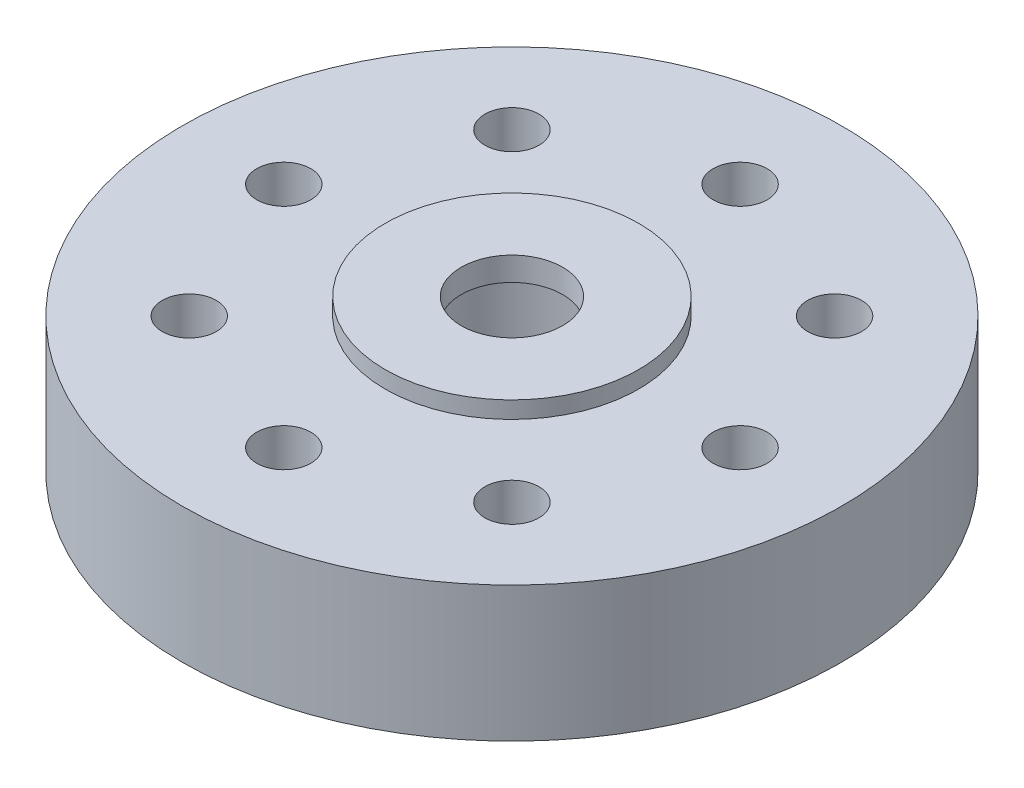
ISO-10303-21;
HEADER;
FILE_DESCRIPTION(('STEP AP214'),'2;1');
FILE_NAME('part.step','',(''),(''),'','','');
FILE_SCHEMA(('AUTOMOTIVE_DESIGN { 1 0 10303 214 1 1 1 1 }'));
ENDSEC;
DATA;
#1=APPLICATION_CONTEXT('core data for automotive mechanical design processes');
#2=APPLICATION_PROTOCOL_DEFINITION('international standard','automotive_design',2000,#1);
#3=PRODUCT_CONTEXT('',#1,'mechanical');
#4=PRODUCT('Part','Part','',(#3));
#5=PRODUCT_RELATED_PRODUCT_CATEGORY('part','',(#4));
#6=PRODUCT_DEFINITION_FORMATION('','',#4);
#7=PRODUCT_DEFINITION_CONTEXT('part definition',#1,'design');
#8=PRODUCT_DEFINITION('design','',#6,#7);
#9=PRODUCT_DEFINITION_SHAPE('','',#8);
#10=(LENGTH_UNIT() NAMED_UNIT(*) SI_UNIT(.MILLI.,.METRE.));
#11=(NAMED_UNIT(*) PLANE_ANGLE_UNIT() SI_UNIT($,.RADIAN.));
#12=(NAMED_UNIT(*) SI_UNIT($,.STERADIAN.) SOLID_ANGLE_UNIT());
#13=UNCERTAINTY_MEASURE_WITH_UNIT(LENGTH_MEASURE(1.E-05),#10,'distance_accuracy_value','');
#14=(GEOMETRIC_REPRESENTATION_CONTEXT(3) GLOBAL_UNCERTAINTY_ASSIGNED_CONTEXT((#13)) GLOBAL_UNIT_ASSIGNED_CONTEXT((#10,
#11,#12)) REPRESENTATION_CONTEXT('',''));
#15=CARTESIAN_POINT('',(0.,0.,0.));
#16=DIRECTION('',(0.,0.,1.));
#17=DIRECTION('',(1.,0.,0.));
#18=AXIS2_PLACEMENT_3D('',#15,#16,#17);
#19=CARTESIAN_POINT('',(0.,2.,0.));
#20=DIRECTION('',(0.,-1.,0.));
#21=DIRECTION('',(0.,0.,-1.));
#22=AXIS2_PLACEMENT_3D('',#19,#20,#21);
#23=CYLINDRICAL_SURFACE('',#22,1.5);
#24=CARTESIAN_POINT('',(0.,2.5,0.));
#25=DIRECTION('',(0.,1.,0.));
#26=DIRECTION('',(0.,0.,1.));
#27=AXIS2_PLACEMENT_3D('',#24,#25,#26);
#28=CIRCLE('',#27,1.5);
#29=CARTESIAN_POINT('',(0.,2.5,1.5));
#30=VERTEX_POINT('',#29);
#31=EDGE_CURVE('E250',#30,#30,#28,.T.);
#32=ORIENTED_EDGE('',*,*,#31,.T.);
#33=EDGE_LOOP('',(#32));
#34=FACE_BOUND('',#33,.T.);
#35=CARTESIAN_POINT('',(0.,1.8,0.));
#36=DIRECTION('',(0.,-1.,0.));
#37=DIRECTION('',(0.,0.,-1.));
#38=AXIS2_PLACEMENT_3D('',#35,#36,#37);
#39=CIRCLE('',#38,1.5);
#40=CARTESIAN_POINT('',(0.,1.8,-1.5));
#41=VERTEX_POINT('',#40);
#42=EDGE_CURVE('E331',#41,#41,#39,.T.);
#43=ORIENTED_EDGE('',*,*,#42,.T.);
#44=EDGE_LOOP('',(#43));
#45=FACE_BOUND('',#44,.T.);
#46=ADVANCED_FACE('F36',(#34,#45),#23,.F.);
#47=CARTESIAN_POINT('',(0.,-2.,0.));
#48=DIRECTION('',(0.,1.,0.));
#49=DIRECTION('',(0.,0.,1.));
#50=AXIS2_PLACEMENT_3D('',#47,#48,#49);
#51=PLANE('',#50);
#52=CARTESIAN_POINT('',(0.,-2.,0.));
#53=DIRECTION('',(0.,1.,0.));
#54=DIRECTION('',(0.,0.,1.));
#55=AXIS2_PLACEMENT_3D('',#52,#53,#54);
#56=CIRCLE('',#55,9.75);
#57=CARTESIAN_POINT('',(0.,-2.,9.75));
#58=VERTEX_POINT('',#57);
#59=EDGE_CURVE('E287',#58,#58,#56,.T.);
#60=ORIENTED_EDGE('',*,*,#59,.F.);
#61=EDGE_LOOP('',(#60));
#62=FACE_BOUND('',#61,.T.);
#63=CARTESIAN_POINT('',(6.75,-2.,0.));
#64=DIRECTION('',(0.,1.,0.));
#65=DIRECTION('',(0.,0.,1.));
#66=AXIS2_PLACEMENT_3D('',#63,#64,#65);
#67=CIRCLE('',#66,0.800000000000001);
#68=CARTESIAN_POINT('',(6.75,-2.,0.800000000000001));
#69=VERTEX_POINT('',#68);
#70=EDGE_CURVE('E327',#69,#69,#67,.T.);
#71=ORIENTED_EDGE('',*,*,#70,.T.);
#72=EDGE_LOOP('',(#71));
#73=FACE_BOUND('',#72,.T.);
#74=CARTESIAN_POINT('',(0.,-2.,6.75));
#75=DIRECTION('',(0.,1.,0.));
#76=DIRECTION('',(0.,0.,1.));
#77=AXIS2_PLACEMENT_3D('',#74,#75,#76);
#78=CIRCLE('',#77,0.8);
#79=CARTESIAN_POINT('',(0.,-2.,7.55));
#80=VERTEX_POINT('',#79);
#81=EDGE_CURVE('E324',#80,#80,#78,.T.);
#82=ORIENTED_EDGE('',*,*,#81,.T.);
#83=EDGE_LOOP('',(#82));
#84=FACE_BOUND('',#83,.T.);
#85=CARTESIAN_POINT('',(-6.75,-2.,0.));
#86=DIRECTION('',(0.,1.,0.));
#87=DIRECTION('',(0.,0.,1.));
#88=AXIS2_PLACEMENT_3D('',#85,#86,#87);
#89=CIRCLE('',#88,0.800000000000001);
#90=CARTESIAN_POINT('',(-6.75,-2.,0.800000000000001));
#91=VERTEX_POINT('',#90);
#92=EDGE_CURVE('E321',#91,#91,#89,.T.);
#93=ORIENTED_EDGE('',*,*,#92,.T.);
#94=EDGE_LOOP('',(#93));
#95=FACE_BOUND('',#94,.T.);
#96=CARTESIAN_POINT('',(0.,-2.,-6.75));
#97=DIRECTION('',(0.,1.,0.));
#98=DIRECTION('',(0.,0.,1.));
#99=AXIS2_PLACEMENT_3D('',#96,#97,#98);
#100=CIRCLE('',#99,0.8);
#101=CARTESIAN_POINT('',(0.,-2.,-5.95));
#102=VERTEX_POINT('',#101);
#103=EDGE_CURVE('E318',#102,#102,#100,.T.);
#104=ORIENTED_EDGE('',*,*,#103,.T.);
#105=EDGE_LOOP('',(#104));
#106=FACE_BOUND('',#105,.T.);
#107=CARTESIAN_POINT('',(4.7729707730092,-2.,4.7729707730092));
#108=DIRECTION('',(0.,1.,0.));
#109=DIRECTION('',(0.,0.,1.));
#110=AXIS2_PLACEMENT_3D('',#107,#108,#109);
#111=CIRCLE('',#110,0.800000000000001);
#112=CARTESIAN_POINT('',(4.7729707730092,-2.,5.5729707730092));
#113=VERTEX_POINT('',#112);
#114=EDGE_CURVE('E315',#113,#113,#111,.T.);
#115=ORIENTED_EDGE('',*,*,#114,.T.);
#116=EDGE_LOOP('',(#115));
#117=FACE_BOUND('',#116,.T.);
#118=CARTESIAN_POINT('',(-4.7729707730092,-2.,4.7729707730092));
#119=DIRECTION('',(0.,1.,0.));
#120=DIRECTION('',(0.,0.,1.));
#121=AXIS2_PLACEMENT_3D('',#118,#119,#120);
#122=CIRCLE('',#121,0.8);
#123=CARTESIAN_POINT('',(-4.7729707730092,-2.,5.5729707730092));
#124=VERTEX_POINT('',#123);
#125=EDGE_CURVE('E312',#124,#124,#122,.T.);
#126=ORIENTED_EDGE('',*,*,#125,.T.);
#127=EDGE_LOOP('',(#126));
#128=FACE_BOUND('',#127,.T.);
#129=CARTESIAN_POINT('',(-4.7729707730092,-2.,-4.7729707730092));
#130=DIRECTION('',(0.,1.,0.));
#131=DIRECTION('',(0.,0.,1.));
#132=AXIS2_PLACEMENT_3D('',#129,#130,#131);
#133=CIRCLE('',#132,0.8);
#134=CARTESIAN_POINT('',(-4.7729707730092,-2.,-3.97297077300919));
#135=VERTEX_POINT('',#134);
#136=EDGE_CURVE('E309',#135,#135,#133,.T.);
#137=ORIENTED_EDGE('',*,*,#136,.T.);
#138=EDGE_LOOP('',(#137));
#139=FACE_BOUND('',#138,.T.);
#140=CARTESIAN_POINT('',(4.77297077300919,-2.,-4.7729707730092));
#141=DIRECTION('',(0.,1.,0.));
#142=DIRECTION('',(0.,0.,1.));
#143=AXIS2_PLACEMENT_3D('',#140,#141,#142);
#144=CIRCLE('',#143,0.800000000000001);
#145=CARTESIAN_POINT('',(4.77297077300919,-2.,-3.9729707730092));
#146=VERTEX_POINT('',#145);
#147=EDGE_CURVE('E282',#146,#146,#144,.T.);
#148=ORIENTED_EDGE('',*,*,#147,.T.);
#149=EDGE_LOOP('',(#148));
#150=FACE_BOUND('',#149,.T.);
#151=CARTESIAN_POINT('',(4.77297077300919,-2.,4.7729707730092));
#152=DIRECTION('',(0.,-1.,0.));
#153=DIRECTION('',(0.,0.,-1.));
#154=AXIS2_PLACEMENT_3D('',#151,#152,#153);
#155=CIRCLE('',#154,2.);
#156=CARTESIAN_POINT('',(5.31331654942509,-2.,6.69859442313128));
#157=VERTEX_POINT('',#156);
#158=CARTESIAN_POINT('',(6.69859442313128,-2.,5.31331654942509));
#159=VERTEX_POINT('',#158);
#160=EDGE_CURVE('E53',#157,#159,#155,.T.);
#161=ORIENTED_EDGE('',*,*,#160,.T.);
#162=CARTESIAN_POINT('',(0.,-2.,0.));
#163=DIRECTION('',(0.,-1.,0.));
#164=DIRECTION('',(0.,0.,-1.));
#165=AXIS2_PLACEMENT_3D('',#162,#163,#164);
#166=CIRCLE('',#165,8.55);
#167=CARTESIAN_POINT('',(8.49370370370371,-2.,0.979539378325329));
#168=VERTEX_POINT('',#167);
#169=EDGE_CURVE('E224',#168,#159,#166,.T.);
#170=ORIENTED_EDGE('',*,*,#169,.F.);
#171=CARTESIAN_POINT('',(6.75,-2.,0.));
#172=DIRECTION('',(0.,-1.,0.));
#173=DIRECTION('',(0.,0.,-1.));
#174=AXIS2_PLACEMENT_3D('',#171,#172,#173);
#175=CIRCLE('',#174,2.);
#176=CARTESIAN_POINT('',(8.49370370370371,-2.,-0.979539378325329));
#177=VERTEX_POINT('',#176);
#178=EDGE_CURVE('E247',#168,#177,#175,.T.);
#179=ORIENTED_EDGE('',*,*,#178,.T.);
#180=CARTESIAN_POINT('',(6.69859442313128,-2.,-5.31331654942509));
#181=VERTEX_POINT('',#180);
#182=EDGE_CURVE('E170',#181,#177,#166,.T.);
#183=ORIENTED_EDGE('',*,*,#182,.F.);
#184=CARTESIAN_POINT('',(4.7729707730092,-2.,-4.7729707730092));
#185=DIRECTION('',(0.,-1.,0.));
#186=DIRECTION('',(0.,0.,-1.));
#187=AXIS2_PLACEMENT_3D('',#184,#185,#186);
#188=CIRCLE('',#187,2.);
#189=CARTESIAN_POINT('',(5.31331654942509,-2.,-6.69859442313128));
#190=VERTEX_POINT('',#189);
#191=EDGE_CURVE('E244',#181,#190,#188,.T.);
#192=ORIENTED_EDGE('',*,*,#191,.T.);
#193=CARTESIAN_POINT('',(0.97953937832533,-2.,-8.49370370370371));
#194=VERTEX_POINT('',#193);
#195=EDGE_CURVE('E243',#194,#190,#166,.T.);
#196=ORIENTED_EDGE('',*,*,#195,.F.);
#197=CARTESIAN_POINT('',(0.,-2.,-6.75));
#198=DIRECTION('',(0.,-1.,0.));
#199=DIRECTION('',(0.,0.,-1.));
#200=AXIS2_PLACEMENT_3D('',#197,#198,#199);
#201=CIRCLE('',#200,2.);
#202=CARTESIAN_POINT('',(-0.979539378325328,-2.,-8.49370370370371));
#203=VERTEX_POINT('',#202);
#204=EDGE_CURVE('E240',#194,#203,#201,.T.);
#205=ORIENTED_EDGE('',*,*,#204,.T.);
#206=CARTESIAN_POINT('',(-5.31331654942509,-2.,-6.69859442313128));
#207=VERTEX_POINT('',#206);
#208=EDGE_CURVE('E239',#207,#203,#166,.T.);
#209=ORIENTED_EDGE('',*,*,#208,.F.);
#210=CARTESIAN_POINT('',(-4.7729707730092,-2.,-4.7729707730092));
#211=DIRECTION('',(0.,-1.,0.));
#212=DIRECTION('',(0.,0.,-1.));
#213=AXIS2_PLACEMENT_3D('',#210,#211,#212);
#214=CIRCLE('',#213,2.);
#215=CARTESIAN_POINT('',(-6.69859442313128,-2.,-5.31331654942509));
#216=VERTEX_POINT('',#215);
#217=EDGE_CURVE('E236',#207,#216,#214,.T.);
#218=ORIENTED_EDGE('',*,*,#217,.T.);
#219=CARTESIAN_POINT('',(-8.49370370370371,-2.,-0.97953937832533));
#220=VERTEX_POINT('',#219);
#221=EDGE_CURVE('E235',#220,#216,#166,.T.);
#222=ORIENTED_EDGE('',*,*,#221,.F.);
#223=CARTESIAN_POINT('',(-6.75,-2.,0.));
#224=DIRECTION('',(0.,-1.,0.));
#225=DIRECTION('',(0.,0.,-1.));
#226=AXIS2_PLACEMENT_3D('',#223,#224,#225);
#227=CIRCLE('',#226,2.);
#228=CARTESIAN_POINT('',(-8.49370370370371,-2.,0.979539378325327));
#229=VERTEX_POINT('',#228);
#230=EDGE_CURVE('E232',#220,#229,#227,.T.);
#231=ORIENTED_EDGE('',*,*,#230,.T.);
#232=CARTESIAN_POINT('',(-6.69859442313128,-2.,5.31331654942509));
#233=VERTEX_POINT('',#232);
#234=EDGE_CURVE('E231',#233,#229,#166,.T.);
#235=ORIENTED_EDGE('',*,*,#234,.F.);
#236=CARTESIAN_POINT('',(-4.7729707730092,-2.,4.7729707730092));
#237=DIRECTION('',(0.,-1.,0.));
#238=DIRECTION('',(0.,0.,-1.));
#239=AXIS2_PLACEMENT_3D('',#236,#237,#238);
#240=CIRCLE('',#239,2.);
#241=CARTESIAN_POINT('',(-5.31331654942509,-2.,6.69859442313128));
#242=VERTEX_POINT('',#241);
#243=EDGE_CURVE('E228',#233,#242,#240,.T.);
#244=ORIENTED_EDGE('',*,*,#243,.T.);
#245=CARTESIAN_POINT('',(-0.979539378325331,-2.,8.49370370370371));
#246=VERTEX_POINT('',#245);
#247=EDGE_CURVE('E225',#246,#242,#166,.T.);
#248=ORIENTED_EDGE('',*,*,#247,.F.);
#249=CARTESIAN_POINT('',(0.,-2.,6.75));
#250=DIRECTION('',(0.,-1.,0.));
#251=DIRECTION('',(0.,0.,-1.));
#252=AXIS2_PLACEMENT_3D('',#249,#250,#251);
#253=CIRCLE('',#252,2.);
#254=CARTESIAN_POINT('',(0.979539378325327,-2.,8.49370370370371));
#255=VERTEX_POINT('',#254);
#256=EDGE_CURVE('E223',#246,#255,#253,.T.);
#257=ORIENTED_EDGE('',*,*,#256,.T.);
#258=EDGE_CURVE('E219',#157,#255,#166,.T.);
#259=ORIENTED_EDGE('',*,*,#258,.F.);
#260=EDGE_LOOP('',(#161,#170,#179,#183,#192,#196,#205,#209,#218,#222,#231,#235,#244,#248,#257,#259));
#261=FACE_BOUND('',#260,.T.);
#262=ADVANCED_FACE('F372',(#62,#73,#84,#95,#106,#117,#128,#139,#150,#261),#51,.F.);
#263=CARTESIAN_POINT('',(0.,2.,0.));
#264=DIRECTION('',(0.,-1.,0.));
#265=DIRECTION('',(0.,0.,-1.));
#266=AXIS2_PLACEMENT_3D('',#263,#264,#265);
#267=CYLINDRICAL_SURFACE('',#266,9.75);
#268=CARTESIAN_POINT('',(0.,2.,0.));
#269=DIRECTION('',(0.,1.,0.));
#270=DIRECTION('',(0.,0.,1.));
#271=AXIS2_PLACEMENT_3D('',#268,#269,#270);
#272=CIRCLE('',#271,9.75);
#273=CARTESIAN_POINT('',(0.,2.,9.75));
#274=VERTEX_POINT('',#273);
#275=EDGE_CURVE('E11',#274,#274,#272,.T.);
#276=ORIENTED_EDGE('',*,*,#275,.F.);
#277=EDGE_LOOP('',(#276));
#278=FACE_BOUND('',#277,.T.);
#279=ORIENTED_EDGE('',*,*,#59,.T.);
#280=EDGE_LOOP('',(#279));
#281=FACE_BOUND('',#280,.T.);
#282=ADVANCED_FACE('F410',(#278,#281),#267,.T.);
#283=CARTESIAN_POINT('',(6.75,2.,0.));
#284=DIRECTION('',(0.,-1.,0.));
#285=DIRECTION('',(0.,0.,-1.));
#286=AXIS2_PLACEMENT_3D('',#283,#284,#285);
#287=CYLINDRICAL_SURFACE('',#286,0.800000000000001);
#288=CARTESIAN_POINT('',(6.75,2.,0.));
#289=DIRECTION('',(0.,1.,0.));
#290=DIRECTION('',(0.,0.,1.));
#291=AXIS2_PLACEMENT_3D('',#288,#289,#290);
#292=CIRCLE('',#291,0.800000000000001);
#293=CARTESIAN_POINT('',(6.75,2.,0.800000000000001));
#294=VERTEX_POINT('',#293);
#295=EDGE_CURVE('E45',#294,#294,#292,.T.);
#296=ORIENTED_EDGE('',*,*,#295,.T.);
#297=EDGE_LOOP('',(#296));
#298=FACE_BOUND('',#297,.T.);
#299=ORIENTED_EDGE('',*,*,#70,.F.);
#300=EDGE_LOOP('',(#299));
#301=FACE_BOUND('',#300,.T.);
#302=ADVANCED_FACE('F417',(#298,#301),#287,.F.);
#303=CARTESIAN_POINT('',(0.,2.,6.75));
#304=DIRECTION('',(0.,-1.,0.));
#305=DIRECTION('',(0.,0.,-1.));
#306=AXIS2_PLACEMENT_3D('',#303,#304,#305);
#307=CYLINDRICAL_SURFACE('',#306,0.8);
#308=CARTESIAN_POINT('',(0.,2.,6.75));
#309=DIRECTION('',(0.,1.,0.));
#310=DIRECTION('',(0.,0.,1.));
#311=AXIS2_PLACEMENT_3D('',#308,#309,#310);
#312=CIRCLE('',#311,0.8);
#313=CARTESIAN_POINT('',(0.,2.,7.55));
#314=VERTEX_POINT('',#313);
#315=EDGE_CURVE('E302',#314,#314,#312,.T.);
#316=ORIENTED_EDGE('',*,*,#315,.T.);
#317=EDGE_LOOP('',(#316));
#318=FACE_BOUND('',#317,.T.);
#319=ORIENTED_EDGE('',*,*,#81,.F.);
#320=EDGE_LOOP('',(#319));
#321=FACE_BOUND('',#320,.T.);
#322=ADVANCED_FACE('F421',(#318,#321),#307,.F.);
#323=CARTESIAN_POINT('',(-6.75,2.,0.));
#324=DIRECTION('',(0.,-1.,0.));
#325=DIRECTION('',(0.,0.,-1.));
#326=AXIS2_PLACEMENT_3D('',#323,#324,#325);
#327=CYLINDRICAL_SURFACE('',#326,0.800000000000001);
#328=CARTESIAN_POINT('',(-6.75,2.,0.));
#329=DIRECTION('',(0.,1.,0.));
#330=DIRECTION('',(0.,0.,1.));
#331=AXIS2_PLACEMENT_3D('',#328,#329,#330);
#332=CIRCLE('',#331,0.800000000000001);
#333=CARTESIAN_POINT('',(-6.75,2.,0.800000000000001));
#334=VERTEX_POINT('',#333);
#335=EDGE_CURVE('E299',#334,#334,#332,.T.);
#336=ORIENTED_EDGE('',*,*,#335,.T.);
#337=EDGE_LOOP('',(#336));
#338=FACE_BOUND('',#337,.T.);
#339=ORIENTED_EDGE('',*,*,#92,.F.);
#340=EDGE_LOOP('',(#339));
#341=FACE_BOUND('',#340,.T.);
#342=ADVANCED_FACE('F425',(#338,#341),#327,.F.);
#343=CARTESIAN_POINT('',(0.,2.,-6.75));
#344=DIRECTION('',(0.,-1.,0.));
#345=DIRECTION('',(0.,0.,-1.));
#346=AXIS2_PLACEMENT_3D('',#343,#344,#345);
#347=CYLINDRICAL_SURFACE('',#346,0.8);
#348=CARTESIAN_POINT('',(0.,2.,-6.75));
#349=DIRECTION('',(0.,1.,0.));
#350=DIRECTION('',(0.,0.,1.));
#351=AXIS2_PLACEMENT_3D('',#348,#349,#350);
#352=CIRCLE('',#351,0.8);
#353=CARTESIAN_POINT('',(0.,2.,-5.95));
#354=VERTEX_POINT('',#353);
#355=EDGE_CURVE('E296',#354,#354,#352,.T.);
#356=ORIENTED_EDGE('',*,*,#355,.T.);
#357=EDGE_LOOP('',(#356));
#358=FACE_BOUND('',#357,.T.);
#359=ORIENTED_EDGE('',*,*,#103,.F.);
#360=EDGE_LOOP('',(#359));
#361=FACE_BOUND('',#360,.T.);
#362=ADVANCED_FACE('F429',(#358,#361),#347,.F.);
#363=CARTESIAN_POINT('',(4.7729707730092,2.,4.7729707730092));
#364=DIRECTION('',(0.,-1.,0.));
#365=DIRECTION('',(0.,0.,-1.));
#366=AXIS2_PLACEMENT_3D('',#363,#364,#365);
#367=CYLINDRICAL_SURFACE('',#366,0.800000000000001);
#368=CARTESIAN_POINT('',(4.7729707730092,2.,4.7729707730092));
#369=DIRECTION('',(0.,1.,0.));
#370=DIRECTION('',(0.,0.,1.));
#371=AXIS2_PLACEMENT_3D('',#368,#369,#370);
#372=CIRCLE('',#371,0.800000000000001);
#373=CARTESIAN_POINT('',(4.7729707730092,2.,5.5729707730092));
#374=VERTEX_POINT('',#373);
#375=EDGE_CURVE('E293',#374,#374,#372,.T.);
#376=ORIENTED_EDGE('',*,*,#375,.T.);
#377=EDGE_LOOP('',(#376));
#378=FACE_BOUND('',#377,.T.);
#379=ORIENTED_EDGE('',*,*,#114,.F.);
#380=EDGE_LOOP('',(#379));
#381=FACE_BOUND('',#380,.T.);
#382=ADVANCED_FACE('F433',(#378,#381),#367,.F.);
#383=CARTESIAN_POINT('',(-4.7729707730092,2.,4.7729707730092));
#384=DIRECTION('',(0.,-1.,0.));
#385=DIRECTION('',(0.,0.,-1.));
#386=AXIS2_PLACEMENT_3D('',#383,#384,#385);
#387=CYLINDRICAL_SURFACE('',#386,0.8);
#388=CARTESIAN_POINT('',(-4.7729707730092,2.,4.7729707730092));
#389=DIRECTION('',(0.,1.,0.));
#390=DIRECTION('',(0.,0.,1.));
#391=AXIS2_PLACEMENT_3D('',#388,#389,#390);
#392=CIRCLE('',#391,0.8);
#393=CARTESIAN_POINT('',(-4.7729707730092,2.,5.5729707730092));
#394=VERTEX_POINT('',#393);
#395=EDGE_CURVE('E290',#394,#394,#392,.T.);
#396=ORIENTED_EDGE('',*,*,#395,.T.);
#397=EDGE_LOOP('',(#396));
#398=FACE_BOUND('',#397,.T.);
#399=ORIENTED_EDGE('',*,*,#125,.F.);
#400=EDGE_LOOP('',(#399));
#401=FACE_BOUND('',#400,.T.);
#402=ADVANCED_FACE('F437',(#398,#401),#387,.F.);
#403=CARTESIAN_POINT('',(-4.7729707730092,2.,-4.7729707730092));
#404=DIRECTION('',(0.,-1.,0.));
#405=DIRECTION('',(0.,0.,-1.));
#406=AXIS2_PLACEMENT_3D('',#403,#404,#405);
#407=CYLINDRICAL_SURFACE('',#406,0.8);
#408=CARTESIAN_POINT('',(-4.7729707730092,2.,-4.7729707730092));
#409=DIRECTION('',(0.,1.,0.));
#410=DIRECTION('',(0.,0.,1.));
#411=AXIS2_PLACEMENT_3D('',#408,#409,#410);
#412=CIRCLE('',#411,0.8);
#413=CARTESIAN_POINT('',(-4.7729707730092,2.,-3.97297077300919));
#414=VERTEX_POINT('',#413);
#415=EDGE_CURVE('E286',#414,#414,#412,.T.);
#416=ORIENTED_EDGE('',*,*,#415,.T.);
#417=EDGE_LOOP('',(#416));
#418=FACE_BOUND('',#417,.T.);
#419=ORIENTED_EDGE('',*,*,#136,.F.);
#420=EDGE_LOOP('',(#419));
#421=FACE_BOUND('',#420,.T.);
#422=ADVANCED_FACE('F440',(#418,#421),#407,.F.);
#423=CARTESIAN_POINT('',(4.77297077300919,2.,-4.7729707730092));
#424=DIRECTION('',(0.,-1.,0.));
#425=DIRECTION('',(0.,0.,-1.));
#426=AXIS2_PLACEMENT_3D('',#423,#424,#425);
#427=CYLINDRICAL_SURFACE('',#426,0.800000000000001);
#428=CARTESIAN_POINT('',(4.77297077300919,2.,-4.7729707730092));
#429=DIRECTION('',(0.,1.,0.));
#430=DIRECTION('',(0.,0.,1.));
#431=AXIS2_PLACEMENT_3D('',#428,#429,#430);
#432=CIRCLE('',#431,0.800000000000001);
#433=CARTESIAN_POINT('',(4.77297077300919,2.,-3.9729707730092));
#434=VERTEX_POINT('',#433);
#435=EDGE_CURVE('E283',#434,#434,#432,.T.);
#436=ORIENTED_EDGE('',*,*,#435,.T.);
#437=EDGE_LOOP('',(#436));
#438=FACE_BOUND('',#437,.T.);
#439=ORIENTED_EDGE('',*,*,#147,.F.);
#440=EDGE_LOOP('',(#439));
#441=FACE_BOUND('',#440,.T.);
#442=ADVANCED_FACE('F38',(#438,#441),#427,.F.);
#443=CARTESIAN_POINT('',(0.,2.,0.));
#444=DIRECTION('',(0.,1.,0.));
#445=DIRECTION('',(0.,0.,1.));
#446=AXIS2_PLACEMENT_3D('',#443,#444,#445);
#447=PLANE('',#446);
#448=CARTESIAN_POINT('',(0.,2.,0.));
#449=DIRECTION('',(0.,1.,0.));
#450=DIRECTION('',(0.,0.,1.));
#451=AXIS2_PLACEMENT_3D('',#448,#449,#450);
#452=CIRCLE('',#451,3.75);
#453=CARTESIAN_POINT('',(0.,2.,3.75));
#454=VERTEX_POINT('',#453);
#455=EDGE_CURVE('E279',#454,#454,#452,.F.);
#456=ORIENTED_EDGE('',*,*,#455,.T.);
#457=EDGE_LOOP('',(#456));
#458=FACE_BOUND('',#457,.T.);
#459=ORIENTED_EDGE('',*,*,#435,.F.);
#460=EDGE_LOOP('',(#459));
#461=FACE_BOUND('',#460,.T.);
#462=ORIENTED_EDGE('',*,*,#415,.F.);
#463=EDGE_LOOP('',(#462));
#464=FACE_BOUND('',#463,.T.);
#465=ORIENTED_EDGE('',*,*,#395,.F.);
#466=EDGE_LOOP('',(#465));
#467=FACE_BOUND('',#466,.T.);
#468=ORIENTED_EDGE('',*,*,#375,.F.);
#469=EDGE_LOOP('',(#468));
#470=FACE_BOUND('',#469,.T.);
#471=ORIENTED_EDGE('',*,*,#355,.F.);
#472=EDGE_LOOP('',(#471));
#473=FACE_BOUND('',#472,.T.);
#474=ORIENTED_EDGE('',*,*,#335,.F.);
#475=EDGE_LOOP('',(#474));
#476=FACE_BOUND('',#475,.T.);
#477=ORIENTED_EDGE('',*,*,#315,.F.);
#478=EDGE_LOOP('',(#477));
#479=FACE_BOUND('',#478,.T.);
#480=ORIENTED_EDGE('',*,*,#295,.F.);
#481=EDGE_LOOP('',(#480));
#482=FACE_BOUND('',#481,.T.);
#483=ORIENTED_EDGE('',*,*,#275,.T.);
#484=EDGE_LOOP('',(#483));
#485=FACE_BOUND('',#484,.T.);
#486=ADVANCED_FACE('F447',(#458,#461,#464,#467,#470,#473,#476,#479,#482,#485),#447,.T.);
#487=CARTESIAN_POINT('',(0.,-2.5,0.));
#488=DIRECTION('',(0.,1.,0.));
#489=DIRECTION('',(0.,0.,1.));
#490=AXIS2_PLACEMENT_3D('',#487,#488,#489);
#491=PLANE('',#490);
#492=CARTESIAN_POINT('',(0.,-2.5,0.));
#493=DIRECTION('',(0.,1.,0.));
#494=DIRECTION('',(0.,0.,1.));
#495=AXIS2_PLACEMENT_3D('',#492,#493,#494);
#496=CIRCLE('',#495,2.5);
#497=CARTESIAN_POINT('',(0.,-2.5,2.5));
#498=VERTEX_POINT('',#497);
#499=EDGE_CURVE('E40',#498,#498,#496,.T.);
#500=ORIENTED_EDGE('',*,*,#499,.T.);
#501=EDGE_LOOP('',(#500));
#502=FACE_BOUND('',#501,.T.);
#503=CARTESIAN_POINT('',(0.,-2.5,0.));
#504=DIRECTION('',(0.,-1.,0.));
#505=DIRECTION('',(0.,0.,-1.));
#506=AXIS2_PLACEMENT_3D('',#503,#504,#505);
#507=CIRCLE('',#506,4.4);
#508=CARTESIAN_POINT('',(0.,-2.5,-4.4));
#509=VERTEX_POINT('',#508);
#510=EDGE_CURVE('E220',#509,#509,#507,.T.);
#511=ORIENTED_EDGE('',*,*,#510,.T.);
#512=EDGE_LOOP('',(#511));
#513=FACE_BOUND('',#512,.T.);
#514=ADVANCED_FACE('F459',(#502,#513),#491,.F.);
#515=CARTESIAN_POINT('',(0.,2.5,0.));
#516=DIRECTION('',(0.,-1.,0.));
#517=DIRECTION('',(0.,0.,-1.));
#518=AXIS2_PLACEMENT_3D('',#515,#516,#517);
#519=CYLINDRICAL_SURFACE('',#518,3.75);
#520=ORIENTED_EDGE('',*,*,#455,.F.);
#521=EDGE_LOOP('',(#520));
#522=FACE_BOUND('',#521,.T.);
#523=CARTESIAN_POINT('',(0.,2.5,0.));
#524=DIRECTION('',(0.,1.,0.));
#525=DIRECTION('',(0.,0.,1.));
#526=AXIS2_PLACEMENT_3D('',#523,#524,#525);
#527=CIRCLE('',#526,3.75);
#528=CARTESIAN_POINT('',(0.,2.5,3.75));
#529=VERTEX_POINT('',#528);
#530=EDGE_CURVE('E276',#529,#529,#527,.T.);
#531=ORIENTED_EDGE('',*,*,#530,.F.);
#532=EDGE_LOOP('',(#531));
#533=FACE_BOUND('',#532,.T.);
#534=ADVANCED_FACE('F497',(#522,#533),#519,.T.);
#535=CARTESIAN_POINT('',(0.,2.5,0.));
#536=DIRECTION('',(0.,1.,0.));
#537=DIRECTION('',(0.,0.,1.));
#538=AXIS2_PLACEMENT_3D('',#535,#536,#537);
#539=PLANE('',#538);
#540=ORIENTED_EDGE('',*,*,#31,.F.);
#541=EDGE_LOOP('',(#540));
#542=FACE_BOUND('',#541,.T.);
#543=ORIENTED_EDGE('',*,*,#530,.T.);
#544=EDGE_LOOP('',(#543));
#545=FACE_BOUND('',#544,.T.);
#546=ADVANCED_FACE('F503',(#542,#545),#539,.T.);
#547=CARTESIAN_POINT('',(4.77297077300919,1.8,4.7729707730092));
#548=DIRECTION('',(0.,-1.,0.));
#549=DIRECTION('',(0.,0.,-1.));
#550=AXIS2_PLACEMENT_3D('',#547,#548,#549);
#551=CYLINDRICAL_SURFACE('',#550,2.);
#552=ORIENTED_EDGE('',*,*,#160,.F.);
#553=DIRECTION('',(0.,-1.,0.));
#554=VECTOR('',#553,1.);
#555=CARTESIAN_POINT('',(5.31331654942509,1.8,6.69859442313128));
#556=LINE('',#555,#554);
#557=CARTESIAN_POINT('',(5.31331654942509,1.8,6.69859442313128));
#558=VERTEX_POINT('',#557);
#559=EDGE_CURVE('E113',#558,#157,#556,.T.);
#560=ORIENTED_EDGE('',*,*,#559,.F.);
#561=CARTESIAN_POINT('',(4.77297077300919,1.8,4.7729707730092));
#562=DIRECTION('',(0.,-1.,0.));
#563=DIRECTION('',(0.,0.,-1.));
#564=AXIS2_PLACEMENT_3D('',#561,#562,#563);
#565=CIRCLE('',#564,2.);
#566=CARTESIAN_POINT('',(6.69859442313128,1.8,5.31331654942509));
#567=VERTEX_POINT('',#566);
#568=EDGE_CURVE('E59',#558,#567,#565,.T.);
#569=ORIENTED_EDGE('',*,*,#568,.T.);
#570=DIRECTION('',(0.,-1.,0.));
#571=VECTOR('',#570,1.);
#572=CARTESIAN_POINT('',(6.69859442313128,1.8,5.31331654942509));
#573=LINE('',#572,#571);
#574=EDGE_CURVE('E109',#567,#159,#573,.T.);
#575=ORIENTED_EDGE('',*,*,#574,.T.);
#576=EDGE_LOOP('',(#552,#560,#569,#575));
#577=FACE_BOUND('',#576,.T.);
#578=ADVANCED_FACE('F508',(#577),#551,.T.);
#579=CARTESIAN_POINT('',(0.,1.8,0.));
#580=DIRECTION('',(0.,-1.,0.));
#581=DIRECTION('',(0.,0.,-1.));
#582=AXIS2_PLACEMENT_3D('',#579,#580,#581);
#583=CYLINDRICAL_SURFACE('',#582,8.55);
#584=ORIENTED_EDGE('',*,*,#169,.T.);
#585=ORIENTED_EDGE('',*,*,#574,.F.);
#586=CARTESIAN_POINT('',(0.,1.8,0.));
#587=DIRECTION('',(0.,-1.,0.));
#588=DIRECTION('',(0.,0.,-1.));
#589=AXIS2_PLACEMENT_3D('',#586,#587,#588);
#590=CIRCLE('',#589,8.55);
#591=CARTESIAN_POINT('',(8.49370370370371,1.8,0.979539378325329));
#592=VERTEX_POINT('',#591);
#593=EDGE_CURVE('E163',#592,#567,#590,.T.);
#594=ORIENTED_EDGE('',*,*,#593,.F.);
#595=DIRECTION('',(0.,-1.,0.));
#596=VECTOR('',#595,1.);
#597=CARTESIAN_POINT('',(8.49370370370371,1.8,0.979539378325329));
#598=LINE('',#597,#596);
#599=EDGE_CURVE('E158',#592,#168,#598,.T.);
#600=ORIENTED_EDGE('',*,*,#599,.T.);
#601=EDGE_LOOP('',(#584,#585,#594,#600));
#602=FACE_BOUND('',#601,.T.);
#603=ADVANCED_FACE('F399',(#602),#583,.F.);
#604=CARTESIAN_POINT('',(6.75,1.8,0.));
#605=DIRECTION('',(0.,-1.,0.));
#606=DIRECTION('',(0.,0.,-1.));
#607=AXIS2_PLACEMENT_3D('',#604,#605,#606);
#608=CYLINDRICAL_SURFACE('',#607,2.);
#609=ORIENTED_EDGE('',*,*,#178,.F.);
#610=ORIENTED_EDGE('',*,*,#599,.F.);
#611=CARTESIAN_POINT('',(6.75,1.8,0.));
#612=DIRECTION('',(0.,-1.,0.));
#613=DIRECTION('',(0.,0.,-1.));
#614=AXIS2_PLACEMENT_3D('',#611,#612,#613);
#615=CIRCLE('',#614,2.);
#616=CARTESIAN_POINT('',(8.49370370370371,1.8,-0.979539378325329));
#617=VERTEX_POINT('',#616);
#618=EDGE_CURVE('E152',#592,#617,#615,.T.);
#619=ORIENTED_EDGE('',*,*,#618,.T.);
#620=DIRECTION('',(0.,-1.,0.));
#621=VECTOR('',#620,1.);
#622=CARTESIAN_POINT('',(8.49370370370371,1.8,-0.979539378325329));
#623=LINE('',#622,#621);
#624=EDGE_CURVE('E156',#617,#177,#623,.T.);
#625=ORIENTED_EDGE('',*,*,#624,.T.);
#626=EDGE_LOOP('',(#609,#610,#619,#625));
#627=FACE_BOUND('',#626,.T.);
#628=ADVANCED_FACE('F155',(#627),#608,.T.);
#629=ORIENTED_EDGE('',*,*,#182,.T.);
#630=ORIENTED_EDGE('',*,*,#624,.F.);
#631=CARTESIAN_POINT('',(6.69859442313128,1.8,-5.31331654942509));
#632=VERTEX_POINT('',#631);
#633=EDGE_CURVE('E164',#632,#617,#590,.T.);
#634=ORIENTED_EDGE('',*,*,#633,.F.);
#635=DIRECTION('',(0.,-1.,0.));
#636=VECTOR('',#635,1.);
#637=CARTESIAN_POINT('',(6.69859442313128,1.8,-5.31331654942509));
#638=LINE('',#637,#636);
#639=EDGE_CURVE('E172',#632,#181,#638,.T.);
#640=ORIENTED_EDGE('',*,*,#639,.T.);
#641=EDGE_LOOP('',(#629,#630,#634,#640));
#642=FACE_BOUND('',#641,.T.);
#643=ADVANCED_FACE('F168',(#642),#583,.F.);
#644=CARTESIAN_POINT('',(4.7729707730092,1.8,-4.7729707730092));
#645=DIRECTION('',(0.,-1.,0.));
#646=DIRECTION('',(0.,0.,-1.));
#647=AXIS2_PLACEMENT_3D('',#644,#645,#646);
#648=CYLINDRICAL_SURFACE('',#647,2.);
#649=ORIENTED_EDGE('',*,*,#191,.F.);
#650=ORIENTED_EDGE('',*,*,#639,.F.);
#651=CARTESIAN_POINT('',(4.7729707730092,1.8,-4.7729707730092));
#652=DIRECTION('',(0.,-1.,0.));
#653=DIRECTION('',(0.,0.,-1.));
#654=AXIS2_PLACEMENT_3D('',#651,#652,#653);
#655=CIRCLE('',#654,2.);
#656=CARTESIAN_POINT('',(5.31331654942509,1.8,-6.69859442313128));
#657=VERTEX_POINT('',#656);
#658=EDGE_CURVE('E177',#632,#657,#655,.T.);
#659=ORIENTED_EDGE('',*,*,#658,.T.);
#660=DIRECTION('',(0.,-1.,0.));
#661=VECTOR('',#660,1.);
#662=CARTESIAN_POINT('',(5.31331654942509,1.8,-6.69859442313128));
#663=LINE('',#662,#661);
#664=EDGE_CURVE('E253',#657,#190,#663,.T.);
#665=ORIENTED_EDGE('',*,*,#664,.T.);
#666=EDGE_LOOP('',(#649,#650,#659,#665));
#667=FACE_BOUND('',#666,.T.);
#668=ADVANCED_FACE('F388',(#667),#648,.T.);
#669=ORIENTED_EDGE('',*,*,#195,.T.);
#670=ORIENTED_EDGE('',*,*,#664,.F.);
#671=CARTESIAN_POINT('',(0.97953937832533,1.8,-8.49370370370371));
#672=VERTEX_POINT('',#671);
#673=EDGE_CURVE('E179',#672,#657,#590,.T.);
#674=ORIENTED_EDGE('',*,*,#673,.F.);
#675=DIRECTION('',(0.,-1.,0.));
#676=VECTOR('',#675,1.);
#677=CARTESIAN_POINT('',(0.97953937832533,1.8,-8.49370370370371));
#678=LINE('',#677,#676);
#679=EDGE_CURVE('E255',#672,#194,#678,.T.);
#680=ORIENTED_EDGE('',*,*,#679,.T.);
#681=EDGE_LOOP('',(#669,#670,#674,#680));
#682=FACE_BOUND('',#681,.T.);
#683=ADVANCED_FACE('F390',(#682),#583,.F.);
#684=CARTESIAN_POINT('',(0.,1.8,-6.75));
#685=DIRECTION('',(0.,-1.,0.));
#686=DIRECTION('',(0.,0.,-1.));
#687=AXIS2_PLACEMENT_3D('',#684,#685,#686);
#688=CYLINDRICAL_SURFACE('',#687,2.);
#689=ORIENTED_EDGE('',*,*,#204,.F.);
#690=ORIENTED_EDGE('',*,*,#679,.F.);
#691=CARTESIAN_POINT('',(0.,1.8,-6.75));
#692=DIRECTION('',(0.,-1.,0.));
#693=DIRECTION('',(0.,0.,-1.));
#694=AXIS2_PLACEMENT_3D('',#691,#692,#693);
#695=CIRCLE('',#694,2.);
#696=CARTESIAN_POINT('',(-0.979539378325328,1.8,-8.49370370370371));
#697=VERTEX_POINT('',#696);
#698=EDGE_CURVE('E184',#672,#697,#695,.T.);
#699=ORIENTED_EDGE('',*,*,#698,.T.);
#700=DIRECTION('',(0.,-1.,0.));
#701=VECTOR('',#700,1.);
#702=CARTESIAN_POINT('',(-0.979539378325328,1.8,-8.49370370370371));
#703=LINE('',#702,#701);
#704=EDGE_CURVE('E257',#697,#203,#703,.T.);
#705=ORIENTED_EDGE('',*,*,#704,.T.);
#706=EDGE_LOOP('',(#689,#690,#699,#705));
#707=FACE_BOUND('',#706,.T.);
#708=ADVANCED_FACE('F385',(#707),#688,.T.);
#709=ORIENTED_EDGE('',*,*,#208,.T.);
#710=ORIENTED_EDGE('',*,*,#704,.F.);
#711=CARTESIAN_POINT('',(-5.31331654942509,1.8,-6.69859442313128));
#712=VERTEX_POINT('',#711);
#713=EDGE_CURVE('E185',#712,#697,#590,.T.);
#714=ORIENTED_EDGE('',*,*,#713,.F.);
#715=DIRECTION('',(0.,-1.,0.));
#716=VECTOR('',#715,1.);
#717=CARTESIAN_POINT('',(-5.31331654942509,1.8,-6.69859442313128));
#718=LINE('',#717,#716);
#719=EDGE_CURVE('E259',#712,#207,#718,.T.);
#720=ORIENTED_EDGE('',*,*,#719,.T.);
#721=EDGE_LOOP('',(#709,#710,#714,#720));
#722=FACE_BOUND('',#721,.T.);
#723=ADVANCED_FACE('F383',(#722),#583,.F.);
#724=CARTESIAN_POINT('',(-4.7729707730092,1.8,-4.7729707730092));
#725=DIRECTION('',(0.,-1.,0.));
#726=DIRECTION('',(0.,0.,-1.));
#727=AXIS2_PLACEMENT_3D('',#724,#725,#726);
#728=CYLINDRICAL_SURFACE('',#727,2.);
#729=ORIENTED_EDGE('',*,*,#217,.F.);
#730=ORIENTED_EDGE('',*,*,#719,.F.);
#731=CARTESIAN_POINT('',(-4.7729707730092,1.8,-4.7729707730092));
#732=DIRECTION('',(0.,-1.,0.));
#733=DIRECTION('',(0.,0.,-1.));
#734=AXIS2_PLACEMENT_3D('',#731,#732,#733);
#735=CIRCLE('',#734,2.);
#736=CARTESIAN_POINT('',(-6.69859442313128,1.8,-5.31331654942509));
#737=VERTEX_POINT('',#736);
#738=EDGE_CURVE('E207',#712,#737,#735,.T.);
#739=ORIENTED_EDGE('',*,*,#738,.T.);
#740=DIRECTION('',(0.,-1.,0.));
#741=VECTOR('',#740,1.);
#742=CARTESIAN_POINT('',(-6.69859442313128,1.8,-5.31331654942509));
#743=LINE('',#742,#741);
#744=EDGE_CURVE('E261',#737,#216,#743,.T.);
#745=ORIENTED_EDGE('',*,*,#744,.T.);
#746=EDGE_LOOP('',(#729,#730,#739,#745));
#747=FACE_BOUND('',#746,.T.);
#748=ADVANCED_FACE('F382',(#747),#728,.T.);
#749=ORIENTED_EDGE('',*,*,#221,.T.);
#750=ORIENTED_EDGE('',*,*,#744,.F.);
#751=CARTESIAN_POINT('',(-8.49370370370371,1.8,-0.97953937832533));
#752=VERTEX_POINT('',#751);
#753=EDGE_CURVE('E202',#752,#737,#590,.T.);
#754=ORIENTED_EDGE('',*,*,#753,.F.);
#755=DIRECTION('',(0.,-1.,0.));
#756=VECTOR('',#755,1.);
#757=CARTESIAN_POINT('',(-8.49370370370371,1.8,-0.97953937832533));
#758=LINE('',#757,#756);
#759=EDGE_CURVE('E263',#752,#220,#758,.T.);
#760=ORIENTED_EDGE('',*,*,#759,.T.);
#761=EDGE_LOOP('',(#749,#750,#754,#760));
#762=FACE_BOUND('',#761,.T.);
#763=ADVANCED_FACE('F379',(#762),#583,.F.);
#764=CARTESIAN_POINT('',(-6.75,1.8,0.));
#765=DIRECTION('',(0.,-1.,0.));
#766=DIRECTION('',(0.,0.,-1.));
#767=AXIS2_PLACEMENT_3D('',#764,#765,#766);
#768=CYLINDRICAL_SURFACE('',#767,2.);
#769=ORIENTED_EDGE('',*,*,#230,.F.);
#770=ORIENTED_EDGE('',*,*,#759,.F.);
#771=CARTESIAN_POINT('',(-6.75,1.8,0.));
#772=DIRECTION('',(0.,-1.,0.));
#773=DIRECTION('',(0.,0.,-1.));
#774=AXIS2_PLACEMENT_3D('',#771,#772,#773);
#775=CIRCLE('',#774,2.);
#776=CARTESIAN_POINT('',(-8.49370370370371,1.8,0.979539378325327));
#777=VERTEX_POINT('',#776);
#778=EDGE_CURVE('E201',#752,#777,#775,.T.);
#779=ORIENTED_EDGE('',*,*,#778,.T.);
#780=DIRECTION('',(0.,-1.,0.));
#781=VECTOR('',#780,1.);
#782=CARTESIAN_POINT('',(-8.49370370370371,1.8,0.979539378325327));
#783=LINE('',#782,#781);
#784=EDGE_CURVE('E265',#777,#229,#783,.T.);
#785=ORIENTED_EDGE('',*,*,#784,.T.);
#786=EDGE_LOOP('',(#769,#770,#779,#785));
#787=FACE_BOUND('',#786,.T.);
#788=ADVANCED_FACE('F378',(#787),#768,.T.);
#789=ORIENTED_EDGE('',*,*,#234,.T.);
#790=ORIENTED_EDGE('',*,*,#784,.F.);
#791=CARTESIAN_POINT('',(-6.69859442313128,1.8,5.31331654942509));
#792=VERTEX_POINT('',#791);
#793=EDGE_CURVE('E196',#792,#777,#590,.T.);
#794=ORIENTED_EDGE('',*,*,#793,.F.);
#795=DIRECTION('',(0.,-1.,0.));
#796=VECTOR('',#795,1.);
#797=CARTESIAN_POINT('',(-6.69859442313128,1.8,5.31331654942509));
#798=LINE('',#797,#796);
#799=EDGE_CURVE('E267',#792,#233,#798,.T.);
#800=ORIENTED_EDGE('',*,*,#799,.T.);
#801=EDGE_LOOP('',(#789,#790,#794,#800));
#802=FACE_BOUND('',#801,.T.);
#803=ADVANCED_FACE('F375',(#802),#583,.F.);
#804=CARTESIAN_POINT('',(-4.7729707730092,1.8,4.7729707730092));
#805=DIRECTION('',(0.,-1.,0.));
#806=DIRECTION('',(0.,0.,-1.));
#807=AXIS2_PLACEMENT_3D('',#804,#805,#806);
#808=CYLINDRICAL_SURFACE('',#807,2.);
#809=ORIENTED_EDGE('',*,*,#243,.F.);
#810=ORIENTED_EDGE('',*,*,#799,.F.);
#811=CARTESIAN_POINT('',(-4.7729707730092,1.8,4.7729707730092));
#812=DIRECTION('',(0.,-1.,0.));
#813=DIRECTION('',(0.,0.,-1.));
#814=AXIS2_PLACEMENT_3D('',#811,#812,#813);
#815=CIRCLE('',#814,2.);
#816=CARTESIAN_POINT('',(-5.31331654942509,1.8,6.69859442313128));
#817=VERTEX_POINT('',#816);
#818=EDGE_CURVE('E195',#792,#817,#815,.T.);
#819=ORIENTED_EDGE('',*,*,#818,.T.);
#820=DIRECTION('',(0.,-1.,0.));
#821=VECTOR('',#820,1.);
#822=CARTESIAN_POINT('',(-5.31331654942509,1.8,6.69859442313128));
#823=LINE('',#822,#821);
#824=EDGE_CURVE('E269',#817,#242,#823,.T.);
#825=ORIENTED_EDGE('',*,*,#824,.T.);
#826=EDGE_LOOP('',(#809,#810,#819,#825));
#827=FACE_BOUND('',#826,.T.);
#828=ADVANCED_FACE('F374',(#827),#808,.T.);
#829=ORIENTED_EDGE('',*,*,#247,.T.);
#830=ORIENTED_EDGE('',*,*,#824,.F.);
#831=CARTESIAN_POINT('',(-0.979539378325331,1.8,8.49370370370371));
#832=VERTEX_POINT('',#831);
#833=EDGE_CURVE('E190',#832,#817,#590,.T.);
#834=ORIENTED_EDGE('',*,*,#833,.F.);
#835=DIRECTION('',(0.,-1.,0.));
#836=VECTOR('',#835,1.);
#837=CARTESIAN_POINT('',(-0.979539378325331,1.8,8.49370370370371));
#838=LINE('',#837,#836);
#839=EDGE_CURVE('E271',#832,#246,#838,.T.);
#840=ORIENTED_EDGE('',*,*,#839,.T.);
#841=EDGE_LOOP('',(#829,#830,#834,#840));
#842=FACE_BOUND('',#841,.T.);
#843=ADVANCED_FACE('F368',(#842),#583,.F.);
#844=CARTESIAN_POINT('',(0.,1.8,6.75));
#845=DIRECTION('',(0.,-1.,0.));
#846=DIRECTION('',(0.,0.,-1.));
#847=AXIS2_PLACEMENT_3D('',#844,#845,#846);
#848=CYLINDRICAL_SURFACE('',#847,2.);
#849=ORIENTED_EDGE('',*,*,#256,.F.);
#850=ORIENTED_EDGE('',*,*,#839,.F.);
#851=CARTESIAN_POINT('',(0.,1.8,6.75));
#852=DIRECTION('',(0.,-1.,0.));
#853=DIRECTION('',(0.,0.,-1.));
#854=AXIS2_PLACEMENT_3D('',#851,#852,#853);
#855=CIRCLE('',#854,2.);
#856=CARTESIAN_POINT('',(0.979539378325327,1.8,8.49370370370371));
#857=VERTEX_POINT('',#856);
#858=EDGE_CURVE('E189',#832,#857,#855,.T.);
#859=ORIENTED_EDGE('',*,*,#858,.T.);
#860=DIRECTION('',(0.,-1.,0.));
#861=VECTOR('',#860,1.);
#862=CARTESIAN_POINT('',(0.979539378325327,1.8,8.49370370370371));
#863=LINE('',#862,#861);
#864=EDGE_CURVE('E186',#857,#255,#863,.T.);
#865=ORIENTED_EDGE('',*,*,#864,.T.);
#866=EDGE_LOOP('',(#849,#850,#859,#865));
#867=FACE_BOUND('',#866,.T.);
#868=ADVANCED_FACE('F514',(#867),#848,.T.);
#869=CARTESIAN_POINT('',(0.,1.8,0.));
#870=DIRECTION('',(0.,-1.,0.));
#871=DIRECTION('',(0.,0.,-1.));
#872=AXIS2_PLACEMENT_3D('',#869,#870,#871);
#873=CYLINDRICAL_SURFACE('',#872,4.4);
#874=CARTESIAN_POINT('',(0.,1.8,0.));
#875=DIRECTION('',(0.,-1.,0.));
#876=DIRECTION('',(0.,0.,-1.));
#877=AXIS2_PLACEMENT_3D('',#874,#875,#876);
#878=CIRCLE('',#877,4.4);
#879=CARTESIAN_POINT('',(0.,1.8,-4.4));
#880=VERTEX_POINT('',#879);
#881=EDGE_CURVE('E193',#880,#880,#878,.T.);
#882=ORIENTED_EDGE('',*,*,#881,.T.);
#883=EDGE_LOOP('',(#882));
#884=FACE_BOUND('',#883,.T.);
#885=ORIENTED_EDGE('',*,*,#510,.F.);
#886=EDGE_LOOP('',(#885));
#887=FACE_BOUND('',#886,.T.);
#888=ADVANCED_FACE('F510',(#884,#887),#873,.T.);
#889=ORIENTED_EDGE('',*,*,#258,.T.);
#890=ORIENTED_EDGE('',*,*,#864,.F.);
#891=EDGE_CURVE('E181',#558,#857,#590,.T.);
#892=ORIENTED_EDGE('',*,*,#891,.F.);
#893=ORIENTED_EDGE('',*,*,#559,.T.);
#894=EDGE_LOOP('',(#889,#890,#892,#893));
#895=FACE_BOUND('',#894,.T.);
#896=ADVANCED_FACE('F513',(#895),#583,.F.);
#897=CARTESIAN_POINT('',(0.,1.8,0.));
#898=DIRECTION('',(0.,-1.,0.));
#899=DIRECTION('',(0.,0.,-1.));
#900=AXIS2_PLACEMENT_3D('',#897,#898,#899);
#901=PLANE('',#900);
#902=ORIENTED_EDGE('',*,*,#881,.F.);
#903=EDGE_LOOP('',(#902));
#904=FACE_BOUND('',#903,.T.);
#905=ORIENTED_EDGE('',*,*,#568,.F.);
#906=ORIENTED_EDGE('',*,*,#891,.T.);
#907=ORIENTED_EDGE('',*,*,#858,.F.);
#908=ORIENTED_EDGE('',*,*,#833,.T.);
#909=ORIENTED_EDGE('',*,*,#818,.F.);
#910=ORIENTED_EDGE('',*,*,#793,.T.);
#911=ORIENTED_EDGE('',*,*,#778,.F.);
#912=ORIENTED_EDGE('',*,*,#753,.T.);
#913=ORIENTED_EDGE('',*,*,#738,.F.);
#914=ORIENTED_EDGE('',*,*,#713,.T.);
#915=ORIENTED_EDGE('',*,*,#698,.F.);
#916=ORIENTED_EDGE('',*,*,#673,.T.);
#917=ORIENTED_EDGE('',*,*,#658,.F.);
#918=ORIENTED_EDGE('',*,*,#633,.T.);
#919=ORIENTED_EDGE('',*,*,#618,.F.);
#920=ORIENTED_EDGE('',*,*,#593,.T.);
#921=EDGE_LOOP('',(#905,#906,#907,#908,#909,#910,#911,#912,#913,#914,#915,#916,#917,#918,#919,#920));
#922=FACE_BOUND('',#921,.T.);
#923=ADVANCED_FACE('F175',(#904,#922),#901,.T.);
#924=CARTESIAN_POINT('',(0.,1.8,0.));
#925=DIRECTION('',(0.,-1.,0.));
#926=DIRECTION('',(0.,0.,-1.));
#927=AXIS2_PLACEMENT_3D('',#924,#925,#926);
#928=CYLINDRICAL_SURFACE('',#927,2.5);
#929=CARTESIAN_POINT('',(0.,1.8,0.));
#930=DIRECTION('',(0.,-1.,0.));
#931=DIRECTION('',(0.,0.,-1.));
#932=AXIS2_PLACEMENT_3D('',#929,#930,#931);
#933=CIRCLE('',#932,2.5);
#934=CARTESIAN_POINT('',(0.,1.8,-2.5));
#935=VERTEX_POINT('',#934);
#936=EDGE_CURVE('E333',#935,#935,#933,.T.);
#937=ORIENTED_EDGE('',*,*,#936,.F.);
#938=EDGE_LOOP('',(#937));
#939=FACE_BOUND('',#938,.T.);
#940=ORIENTED_EDGE('',*,*,#499,.F.);
#941=EDGE_LOOP('',(#940));
#942=FACE_BOUND('',#941,.T.);
#943=ADVANCED_FACE('F536',(#939,#942),#928,.F.);
#944=CARTESIAN_POINT('',(0.,1.8,0.));
#945=DIRECTION('',(0.,-1.,0.));
#946=DIRECTION('',(0.,0.,-1.));
#947=AXIS2_PLACEMENT_3D('',#944,#945,#946);
#948=PLANE('',#947);
#949=ORIENTED_EDGE('',*,*,#42,.F.);
#950=EDGE_LOOP('',(#949));
#951=FACE_BOUND('',#950,.T.);
#952=ORIENTED_EDGE('',*,*,#936,.T.);
#953=EDGE_LOOP('',(#952));
#954=FACE_BOUND('',#953,.T.);
#955=ADVANCED_FACE('F614',(#951,#954),#948,.T.);
#956=CLOSED_SHELL('',(#46,#262,#282,#302,#322,#342,#362,#382,#402,#422,#442,#486,#514,#534,#546,
#578,#603,#628,#643,#668,#683,#708,#723,#748,#763,#788,#803,#828,#843,#868,#888,#896,#923,#943,#955));
#957=MANIFOLD_SOLID_BREP('B2',#956);
#958=ADVANCED_BREP_SHAPE_REPRESENTATION('',(#18,#957),#14);
#959=SHAPE_DEFINITION_REPRESENTATION(#9,#958);
ENDSEC;
END-ISO-10303-21;
